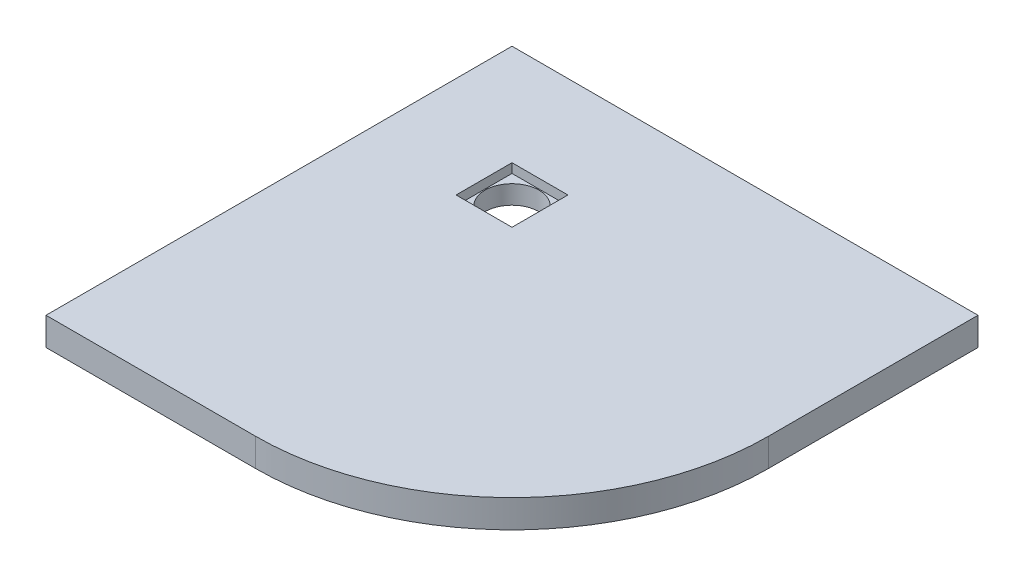
ISO-10303-21;
HEADER;
FILE_DESCRIPTION(('STEP AP214'),'2;1');
FILE_NAME('part.step','',(''),(''),'','','');
FILE_SCHEMA(('AUTOMOTIVE_DESIGN { 1 0 10303 214 1 1 1 1 }'));
ENDSEC;
DATA;
#1=APPLICATION_CONTEXT('core data for automotive mechanical design processes');
#2=APPLICATION_PROTOCOL_DEFINITION('international standard','automotive_design',2000,#1);
#3=PRODUCT_CONTEXT('',#1,'mechanical');
#4=PRODUCT('Part','Part','',(#3));
#5=PRODUCT_RELATED_PRODUCT_CATEGORY('part','',(#4));
#6=PRODUCT_DEFINITION_FORMATION('','',#4);
#7=PRODUCT_DEFINITION_CONTEXT('part definition',#1,'design');
#8=PRODUCT_DEFINITION('design','',#6,#7);
#9=PRODUCT_DEFINITION_SHAPE('','',#8);
#10=(LENGTH_UNIT() NAMED_UNIT(*) SI_UNIT(.MILLI.,.METRE.));
#11=(NAMED_UNIT(*) PLANE_ANGLE_UNIT() SI_UNIT($,.RADIAN.));
#12=(NAMED_UNIT(*) SI_UNIT($,.STERADIAN.) SOLID_ANGLE_UNIT());
#13=UNCERTAINTY_MEASURE_WITH_UNIT(LENGTH_MEASURE(1.E-05),#10,'distance_accuracy_value','');
#14=(GEOMETRIC_REPRESENTATION_CONTEXT(3) GLOBAL_UNCERTAINTY_ASSIGNED_CONTEXT((#13)) GLOBAL_UNIT_ASSIGNED_CONTEXT((#10,
#11,#12)) REPRESENTATION_CONTEXT('',''));
#15=CARTESIAN_POINT('',(0.,0.,0.));
#16=DIRECTION('',(0.,0.,1.));
#17=DIRECTION('',(1.,0.,0.));
#18=AXIS2_PLACEMENT_3D('',#15,#16,#17);
#19=CARTESIAN_POINT('',(0.,60.,1000.));
#20=DIRECTION('',(0.,0.,-1.));
#21=DIRECTION('',(-1.,0.,0.));
#22=AXIS2_PLACEMENT_3D('',#19,#20,#21);
#23=PLANE('',#22);
#24=DIRECTION('',(0.,1.,0.));
#25=VECTOR('',#24,1.);
#26=CARTESIAN_POINT('',(450.,-940.,1000.));
#27=LINE('',#26,#25);
#28=CARTESIAN_POINT('',(450.,60.,1000.));
#29=VERTEX_POINT('',#28);
#30=CARTESIAN_POINT('',(450.,0.,1000.));
#31=VERTEX_POINT('',#30);
#32=EDGE_CURVE('E11',#29,#31,#27,.F.);
#33=ORIENTED_EDGE('',*,*,#32,.F.);
#34=DIRECTION('',(-1.,0.,0.));
#35=VECTOR('',#34,1.);
#36=CARTESIAN_POINT('',(0.,60.,1000.));
#37=LINE('',#36,#35);
#38=CARTESIAN_POINT('',(0.,60.,1000.));
#39=VERTEX_POINT('',#38);
#40=EDGE_CURVE('E160',#29,#39,#37,.T.);
#41=ORIENTED_EDGE('',*,*,#40,.T.);
#42=DIRECTION('',(0.,-1.,0.));
#43=VECTOR('',#42,1.);
#44=CARTESIAN_POINT('',(0.,0.,1000.));
#45=LINE('',#44,#43);
#46=CARTESIAN_POINT('',(0.,0.,1000.));
#47=VERTEX_POINT('',#46);
#48=EDGE_CURVE('E153',#39,#47,#45,.T.);
#49=ORIENTED_EDGE('',*,*,#48,.T.);
#50=DIRECTION('',(1.,0.,0.));
#51=VECTOR('',#50,1.);
#52=CARTESIAN_POINT('',(0.,0.,1000.));
#53=LINE('',#52,#51);
#54=EDGE_CURVE('E156',#47,#31,#53,.T.);
#55=ORIENTED_EDGE('',*,*,#54,.T.);
#56=EDGE_LOOP('',(#33,#41,#49,#55));
#57=FACE_BOUND('',#56,.T.);
#58=ADVANCED_FACE('F33',(#57),#23,.F.);
#59=CARTESIAN_POINT('',(0.,0.,1000.));
#60=DIRECTION('',(1.,0.,0.));
#61=DIRECTION('',(0.,0.,-1.));
#62=AXIS2_PLACEMENT_3D('',#59,#60,#61);
#63=PLANE('',#62);
#64=DIRECTION('',(0.,-1.,0.));
#65=VECTOR('',#64,1.);
#66=CARTESIAN_POINT('',(0.,0.,0.));
#67=LINE('',#66,#65);
#68=CARTESIAN_POINT('',(0.,60.,0.));
#69=VERTEX_POINT('',#68);
#70=CARTESIAN_POINT('',(0.,0.,0.));
#71=VERTEX_POINT('',#70);
#72=EDGE_CURVE('E152',#69,#71,#67,.T.);
#73=ORIENTED_EDGE('',*,*,#72,.T.);
#74=DIRECTION('',(0.,0.,-1.));
#75=VECTOR('',#74,1.);
#76=CARTESIAN_POINT('',(0.,0.,1000.));
#77=LINE('',#76,#75);
#78=EDGE_CURVE('E42',#47,#71,#77,.T.);
#79=ORIENTED_EDGE('',*,*,#78,.F.);
#80=ORIENTED_EDGE('',*,*,#48,.F.);
#81=DIRECTION('',(0.,0.,-1.));
#82=VECTOR('',#81,1.);
#83=CARTESIAN_POINT('',(0.,60.,1000.));
#84=LINE('',#83,#82);
#85=EDGE_CURVE('E162',#39,#69,#84,.T.);
#86=ORIENTED_EDGE('',*,*,#85,.T.);
#87=EDGE_LOOP('',(#73,#79,#80,#86));
#88=FACE_BOUND('',#87,.T.);
#89=ADVANCED_FACE('F35',(#88),#63,.F.);
#90=CARTESIAN_POINT('',(0.,0.,1000.));
#91=DIRECTION('',(0.,1.,0.));
#92=DIRECTION('',(0.,0.,1.));
#93=AXIS2_PLACEMENT_3D('',#90,#91,#92);
#94=PLANE('',#93);
#95=CARTESIAN_POINT('',(276.5,0.,276.5));
#96=DIRECTION('',(0.,1.,0.));
#97=DIRECTION('',(0.,0.,1.));
#98=AXIS2_PLACEMENT_3D('',#95,#96,#97);
#99=CIRCLE('',#98,58.);
#100=CARTESIAN_POINT('',(276.5,0.,334.5));
#101=VERTEX_POINT('',#100);
#102=EDGE_CURVE('E143',#101,#101,#99,.T.);
#103=ORIENTED_EDGE('',*,*,#102,.T.);
#104=EDGE_LOOP('',(#103));
#105=FACE_BOUND('',#104,.T.);
#106=DIRECTION('',(0.,0.,-1.));
#107=VECTOR('',#106,1.);
#108=CARTESIAN_POINT('',(1000.,0.,1000.));
#109=LINE('',#108,#107);
#110=CARTESIAN_POINT('',(1000.,0.,450.));
#111=VERTEX_POINT('',#110);
#112=CARTESIAN_POINT('',(1000.,0.,0.));
#113=VERTEX_POINT('',#112);
#114=EDGE_CURVE('E176',#111,#113,#109,.T.);
#115=ORIENTED_EDGE('',*,*,#114,.F.);
#116=CARTESIAN_POINT('',(450.,0.,450.));
#117=DIRECTION('',(0.,1.,0.));
#118=DIRECTION('',(0.,0.,1.));
#119=AXIS2_PLACEMENT_3D('',#116,#117,#118);
#120=CIRCLE('',#119,550.);
#121=EDGE_CURVE('E149',#111,#31,#120,.F.);
#122=ORIENTED_EDGE('',*,*,#121,.T.);
#123=ORIENTED_EDGE('',*,*,#54,.F.);
#124=ORIENTED_EDGE('',*,*,#78,.T.);
#125=DIRECTION('',(1.,0.,0.));
#126=VECTOR('',#125,1.);
#127=CARTESIAN_POINT('',(0.,0.,0.));
#128=LINE('',#127,#126);
#129=EDGE_CURVE('E165',#71,#113,#128,.T.);
#130=ORIENTED_EDGE('',*,*,#129,.T.);
#131=EDGE_LOOP('',(#115,#122,#123,#124,#130));
#132=FACE_BOUND('',#131,.T.);
#133=ADVANCED_FACE('F182',(#105,#132),#94,.F.);
#134=CARTESIAN_POINT('',(1000.,0.,1000.));
#135=DIRECTION('',(-1.,0.,0.));
#136=DIRECTION('',(0.,0.,1.));
#137=AXIS2_PLACEMENT_3D('',#134,#135,#136);
#138=PLANE('',#137);
#139=DIRECTION('',(0.,0.,-1.));
#140=VECTOR('',#139,1.);
#141=CARTESIAN_POINT('',(1000.,60.,1000.));
#142=LINE('',#141,#140);
#143=CARTESIAN_POINT('',(1000.,60.,450.));
#144=VERTEX_POINT('',#143);
#145=CARTESIAN_POINT('',(1000.,60.,0.));
#146=VERTEX_POINT('',#145);
#147=EDGE_CURVE('E174',#144,#146,#142,.T.);
#148=ORIENTED_EDGE('',*,*,#147,.F.);
#149=DIRECTION('',(0.,1.,0.));
#150=VECTOR('',#149,1.);
#151=CARTESIAN_POINT('',(1000.,-940.,450.));
#152=LINE('',#151,#150);
#153=EDGE_CURVE('E147',#111,#144,#152,.T.);
#154=ORIENTED_EDGE('',*,*,#153,.F.);
#155=ORIENTED_EDGE('',*,*,#114,.T.);
#156=DIRECTION('',(0.,1.,0.));
#157=VECTOR('',#156,1.);
#158=CARTESIAN_POINT('',(1000.,0.,0.));
#159=LINE('',#158,#157);
#160=EDGE_CURVE('E168',#113,#146,#159,.T.);
#161=ORIENTED_EDGE('',*,*,#160,.T.);
#162=EDGE_LOOP('',(#148,#154,#155,#161));
#163=FACE_BOUND('',#162,.T.);
#164=ADVANCED_FACE('F193',(#163),#138,.F.);
#165=CARTESIAN_POINT('',(0.,60.,1000.));
#166=DIRECTION('',(0.,-1.,0.));
#167=DIRECTION('',(0.,0.,-1.));
#168=AXIS2_PLACEMENT_3D('',#165,#166,#167);
#169=PLANE('',#168);
#170=DIRECTION('',(1.,0.,0.));
#171=VECTOR('',#170,1.);
#172=CARTESIAN_POINT('',(216.5,60.,336.5));
#173=LINE('',#172,#171);
#174=CARTESIAN_POINT('',(216.5,60.,336.5));
#175=VERTEX_POINT('',#174);
#176=CARTESIAN_POINT('',(336.5,60.,336.5));
#177=VERTEX_POINT('',#176);
#178=EDGE_CURVE('E134',#175,#177,#173,.T.);
#179=ORIENTED_EDGE('',*,*,#178,.F.);
#180=DIRECTION('',(0.,0.,1.));
#181=VECTOR('',#180,1.);
#182=CARTESIAN_POINT('',(216.5,60.,336.5));
#183=LINE('',#182,#181);
#184=CARTESIAN_POINT('',(216.5,60.,216.5));
#185=VERTEX_POINT('',#184);
#186=EDGE_CURVE('E49',#185,#175,#183,.T.);
#187=ORIENTED_EDGE('',*,*,#186,.F.);
#188=DIRECTION('',(-1.,0.,0.));
#189=VECTOR('',#188,1.);
#190=CARTESIAN_POINT('',(216.5,60.,216.5));
#191=LINE('',#190,#189);
#192=CARTESIAN_POINT('',(336.5,60.,216.5));
#193=VERTEX_POINT('',#192);
#194=EDGE_CURVE('E125',#193,#185,#191,.T.);
#195=ORIENTED_EDGE('',*,*,#194,.F.);
#196=DIRECTION('',(0.,0.,-1.));
#197=VECTOR('',#196,1.);
#198=CARTESIAN_POINT('',(336.5,60.,336.5));
#199=LINE('',#198,#197);
#200=EDGE_CURVE('E128',#177,#193,#199,.T.);
#201=ORIENTED_EDGE('',*,*,#200,.F.);
#202=EDGE_LOOP('',(#179,#187,#195,#201));
#203=FACE_BOUND('',#202,.T.);
#204=ORIENTED_EDGE('',*,*,#40,.F.);
#205=CARTESIAN_POINT('',(450.,60.,450.));
#206=DIRECTION('',(0.,-1.,0.));
#207=DIRECTION('',(0.,0.,1.));
#208=AXIS2_PLACEMENT_3D('',#205,#206,#207);
#209=CIRCLE('',#208,550.);
#210=EDGE_CURVE('E56',#144,#29,#209,.T.);
#211=ORIENTED_EDGE('',*,*,#210,.F.);
#212=ORIENTED_EDGE('',*,*,#147,.T.);
#213=DIRECTION('',(-1.,0.,0.));
#214=VECTOR('',#213,1.);
#215=CARTESIAN_POINT('',(0.,60.,0.));
#216=LINE('',#215,#214);
#217=EDGE_CURVE('E157',#146,#69,#216,.T.);
#218=ORIENTED_EDGE('',*,*,#217,.T.);
#219=ORIENTED_EDGE('',*,*,#85,.F.);
#220=EDGE_LOOP('',(#204,#211,#212,#218,#219));
#221=FACE_BOUND('',#220,.T.);
#222=ADVANCED_FACE('F198',(#203,#221),#169,.F.);
#223=CARTESIAN_POINT('',(0.,60.,0.));
#224=DIRECTION('',(0.,0.,-1.));
#225=DIRECTION('',(-1.,0.,0.));
#226=AXIS2_PLACEMENT_3D('',#223,#224,#225);
#227=PLANE('',#226);
#228=ORIENTED_EDGE('',*,*,#72,.F.);
#229=ORIENTED_EDGE('',*,*,#217,.F.);
#230=ORIENTED_EDGE('',*,*,#160,.F.);
#231=ORIENTED_EDGE('',*,*,#129,.F.);
#232=EDGE_LOOP('',(#228,#229,#230,#231));
#233=FACE_BOUND('',#232,.T.);
#234=ADVANCED_FACE('F190',(#233),#227,.T.);
#235=CARTESIAN_POINT('',(450.,-940.,450.));
#236=DIRECTION('',(0.,1.,0.));
#237=DIRECTION('',(0.,0.,1.));
#238=AXIS2_PLACEMENT_3D('',#235,#236,#237);
#239=CYLINDRICAL_SURFACE('',#238,550.);
#240=ORIENTED_EDGE('',*,*,#153,.T.);
#241=ORIENTED_EDGE('',*,*,#210,.T.);
#242=ORIENTED_EDGE('',*,*,#32,.T.);
#243=ORIENTED_EDGE('',*,*,#121,.F.);
#244=EDGE_LOOP('',(#240,#241,#242,#243));
#245=FACE_BOUND('',#244,.T.);
#246=ADVANCED_FACE('F206',(#245),#239,.T.);
#247=CARTESIAN_POINT('',(276.5,0.,276.5));
#248=DIRECTION('',(0.,1.,0.));
#249=DIRECTION('',(0.,0.,1.));
#250=AXIS2_PLACEMENT_3D('',#247,#248,#249);
#251=CYLINDRICAL_SURFACE('',#250,58.);
#252=CARTESIAN_POINT('',(276.5,40.,276.5));
#253=DIRECTION('',(0.,-1.,0.));
#254=DIRECTION('',(0.,0.,-1.));
#255=AXIS2_PLACEMENT_3D('',#252,#253,#254);
#256=CIRCLE('',#255,58.);
#257=CARTESIAN_POINT('',(276.5,40.,218.5));
#258=VERTEX_POINT('',#257);
#259=EDGE_CURVE('E37',#258,#258,#256,.F.);
#260=ORIENTED_EDGE('',*,*,#259,.T.);
#261=EDGE_LOOP('',(#260));
#262=FACE_BOUND('',#261,.T.);
#263=ORIENTED_EDGE('',*,*,#102,.F.);
#264=EDGE_LOOP('',(#263));
#265=FACE_BOUND('',#264,.T.);
#266=ADVANCED_FACE('F217',(#262,#265),#251,.F.);
#267=CARTESIAN_POINT('',(216.5,40.,216.5));
#268=DIRECTION('',(0.,-1.,0.));
#269=DIRECTION('',(0.,0.,-1.));
#270=AXIS2_PLACEMENT_3D('',#267,#268,#269);
#271=PLANE('',#270);
#272=DIRECTION('',(0.,0.,1.));
#273=VECTOR('',#272,1.);
#274=CARTESIAN_POINT('',(216.5,40.,336.5));
#275=LINE('',#274,#273);
#276=CARTESIAN_POINT('',(216.5,40.,216.5));
#277=VERTEX_POINT('',#276);
#278=CARTESIAN_POINT('',(216.5,40.,336.5));
#279=VERTEX_POINT('',#278);
#280=EDGE_CURVE('E106',#277,#279,#275,.T.);
#281=ORIENTED_EDGE('',*,*,#280,.T.);
#282=DIRECTION('',(1.,0.,0.));
#283=VECTOR('',#282,1.);
#284=CARTESIAN_POINT('',(216.5,40.,336.5));
#285=LINE('',#284,#283);
#286=CARTESIAN_POINT('',(336.5,40.,336.5));
#287=VERTEX_POINT('',#286);
#288=EDGE_CURVE('E115',#279,#287,#285,.T.);
#289=ORIENTED_EDGE('',*,*,#288,.T.);
#290=DIRECTION('',(0.,0.,-1.));
#291=VECTOR('',#290,1.);
#292=CARTESIAN_POINT('',(336.5,40.,336.5));
#293=LINE('',#292,#291);
#294=CARTESIAN_POINT('',(336.5,40.,216.5));
#295=VERTEX_POINT('',#294);
#296=EDGE_CURVE('E120',#287,#295,#293,.T.);
#297=ORIENTED_EDGE('',*,*,#296,.T.);
#298=DIRECTION('',(-1.,0.,0.));
#299=VECTOR('',#298,1.);
#300=CARTESIAN_POINT('',(216.5,40.,216.5));
#301=LINE('',#300,#299);
#302=EDGE_CURVE('E112',#295,#277,#301,.T.);
#303=ORIENTED_EDGE('',*,*,#302,.T.);
#304=EDGE_LOOP('',(#281,#289,#297,#303));
#305=FACE_BOUND('',#304,.T.);
#306=ORIENTED_EDGE('',*,*,#259,.F.);
#307=EDGE_LOOP('',(#306));
#308=FACE_BOUND('',#307,.T.);
#309=ADVANCED_FACE('F122',(#305,#308),#271,.F.);
#310=CARTESIAN_POINT('',(216.5,40.,336.5));
#311=DIRECTION('',(-1.,0.,0.));
#312=DIRECTION('',(0.,0.,1.));
#313=AXIS2_PLACEMENT_3D('',#310,#311,#312);
#314=PLANE('',#313);
#315=ORIENTED_EDGE('',*,*,#186,.T.);
#316=DIRECTION('',(0.,1.,0.));
#317=VECTOR('',#316,1.);
#318=CARTESIAN_POINT('',(216.5,40.,336.5));
#319=LINE('',#318,#317);
#320=EDGE_CURVE('E102',#279,#175,#319,.T.);
#321=ORIENTED_EDGE('',*,*,#320,.F.);
#322=ORIENTED_EDGE('',*,*,#280,.F.);
#323=DIRECTION('',(0.,1.,0.));
#324=VECTOR('',#323,1.);
#325=CARTESIAN_POINT('',(216.5,40.,216.5));
#326=LINE('',#325,#324);
#327=EDGE_CURVE('E138',#277,#185,#326,.T.);
#328=ORIENTED_EDGE('',*,*,#327,.T.);
#329=EDGE_LOOP('',(#315,#321,#322,#328));
#330=FACE_BOUND('',#329,.T.);
#331=ADVANCED_FACE('F104',(#330),#314,.F.);
#332=CARTESIAN_POINT('',(216.5,40.,216.5));
#333=DIRECTION('',(0.,0.,-1.));
#334=DIRECTION('',(-1.,0.,0.));
#335=AXIS2_PLACEMENT_3D('',#332,#333,#334);
#336=PLANE('',#335);
#337=ORIENTED_EDGE('',*,*,#194,.T.);
#338=ORIENTED_EDGE('',*,*,#327,.F.);
#339=ORIENTED_EDGE('',*,*,#302,.F.);
#340=DIRECTION('',(0.,1.,0.));
#341=VECTOR('',#340,1.);
#342=CARTESIAN_POINT('',(336.5,40.,216.5));
#343=LINE('',#342,#341);
#344=EDGE_CURVE('E140',#295,#193,#343,.T.);
#345=ORIENTED_EDGE('',*,*,#344,.T.);
#346=EDGE_LOOP('',(#337,#338,#339,#345));
#347=FACE_BOUND('',#346,.T.);
#348=ADVANCED_FACE('F223',(#347),#336,.F.);
#349=CARTESIAN_POINT('',(336.5,40.,336.5));
#350=DIRECTION('',(1.,0.,0.));
#351=DIRECTION('',(0.,0.,-1.));
#352=AXIS2_PLACEMENT_3D('',#349,#350,#351);
#353=PLANE('',#352);
#354=ORIENTED_EDGE('',*,*,#200,.T.);
#355=ORIENTED_EDGE('',*,*,#344,.F.);
#356=ORIENTED_EDGE('',*,*,#296,.F.);
#357=DIRECTION('',(0.,1.,0.));
#358=VECTOR('',#357,1.);
#359=CARTESIAN_POINT('',(336.5,40.,336.5));
#360=LINE('',#359,#358);
#361=EDGE_CURVE('E111',#287,#177,#360,.T.);
#362=ORIENTED_EDGE('',*,*,#361,.T.);
#363=EDGE_LOOP('',(#354,#355,#356,#362));
#364=FACE_BOUND('',#363,.T.);
#365=ADVANCED_FACE('F226',(#364),#353,.F.);
#366=CARTESIAN_POINT('',(216.5,40.,336.5));
#367=DIRECTION('',(0.,0.,1.));
#368=DIRECTION('',(1.,0.,0.));
#369=AXIS2_PLACEMENT_3D('',#366,#367,#368);
#370=PLANE('',#369);
#371=ORIENTED_EDGE('',*,*,#178,.T.);
#372=ORIENTED_EDGE('',*,*,#361,.F.);
#373=ORIENTED_EDGE('',*,*,#288,.F.);
#374=ORIENTED_EDGE('',*,*,#320,.T.);
#375=EDGE_LOOP('',(#371,#372,#373,#374));
#376=FACE_BOUND('',#375,.T.);
#377=ADVANCED_FACE('F116',(#376),#370,.F.);
#378=CLOSED_SHELL('',(#58,#89,#133,#164,#222,#234,#246,#266,#309,#331,#348,#365,#377));
#379=MANIFOLD_SOLID_BREP('B2',#378);
#380=ADVANCED_BREP_SHAPE_REPRESENTATION('',(#18,#379),#14);
#381=SHAPE_DEFINITION_REPRESENTATION(#9,#380);
ENDSEC;
END-ISO-10303-21;
